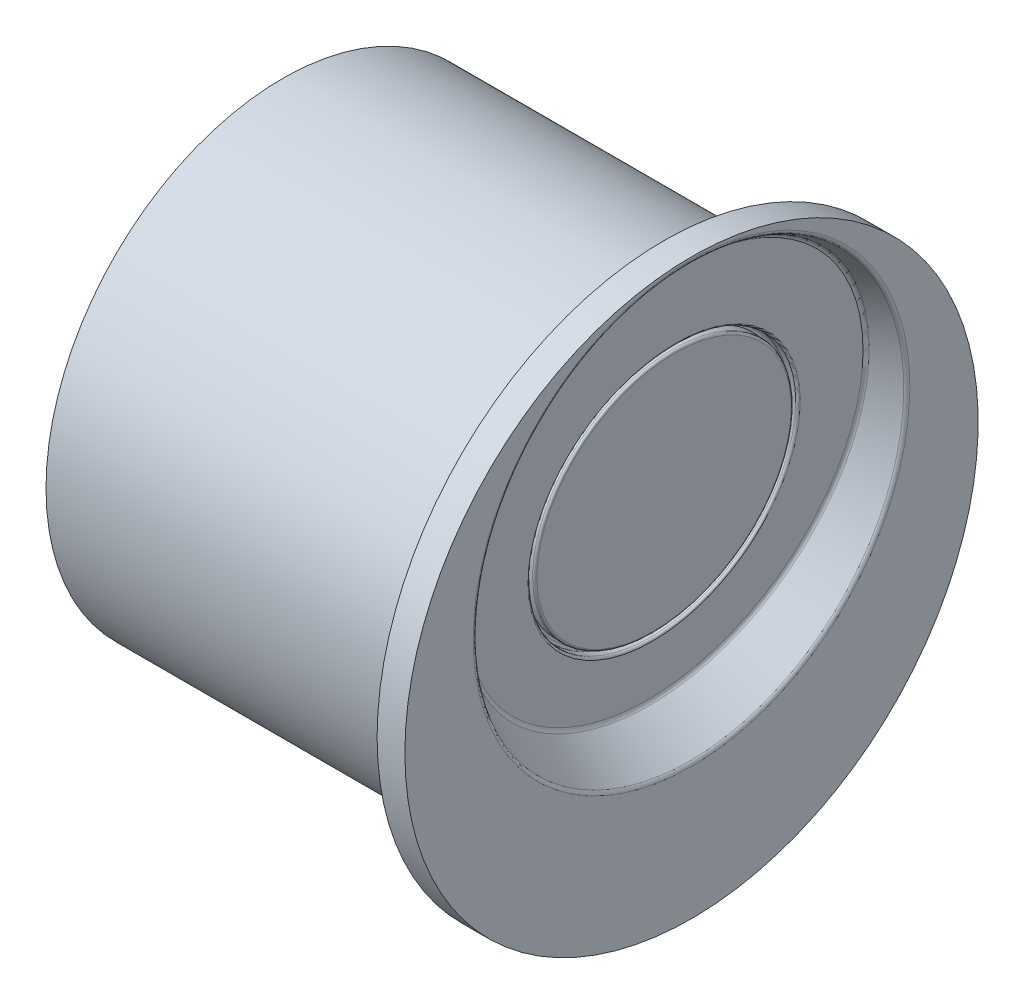
ISO-10303-21;
HEADER;
FILE_DESCRIPTION(('STEP AP214'),'2;1');
FILE_NAME('part.step','',(''),(''),'','','');
FILE_SCHEMA(('AUTOMOTIVE_DESIGN { 1 0 10303 214 1 1 1 1 }'));
ENDSEC;
DATA;
#1=APPLICATION_CONTEXT('core data for automotive mechanical design processes');
#2=APPLICATION_PROTOCOL_DEFINITION('international standard','automotive_design',2000,#1);
#3=PRODUCT_CONTEXT('',#1,'mechanical');
#4=PRODUCT('Part','Part','',(#3));
#5=PRODUCT_RELATED_PRODUCT_CATEGORY('part','',(#4));
#6=PRODUCT_DEFINITION_FORMATION('','',#4);
#7=PRODUCT_DEFINITION_CONTEXT('part definition',#1,'design');
#8=PRODUCT_DEFINITION('design','',#6,#7);
#9=PRODUCT_DEFINITION_SHAPE('','',#8);
#10=(LENGTH_UNIT() NAMED_UNIT(*) SI_UNIT(.MILLI.,.METRE.));
#11=(NAMED_UNIT(*) PLANE_ANGLE_UNIT() SI_UNIT($,.RADIAN.));
#12=(NAMED_UNIT(*) SI_UNIT($,.STERADIAN.) SOLID_ANGLE_UNIT());
#13=UNCERTAINTY_MEASURE_WITH_UNIT(LENGTH_MEASURE(1.E-05),#10,'distance_accuracy_value','');
#14=(GEOMETRIC_REPRESENTATION_CONTEXT(3) GLOBAL_UNCERTAINTY_ASSIGNED_CONTEXT((#13)) GLOBAL_UNIT_ASSIGNED_CONTEXT((#10,
#11,#12)) REPRESENTATION_CONTEXT('',''));
#15=CARTESIAN_POINT('',(0.,0.,0.));
#16=DIRECTION('',(0.,0.,1.));
#17=DIRECTION('',(1.,0.,0.));
#18=AXIS2_PLACEMENT_3D('',#15,#16,#17);
#19=CARTESIAN_POINT('',(0.,0.,0.));
#20=DIRECTION('',(1.,0.,0.));
#21=DIRECTION('',(0.,0.,-1.));
#22=AXIS2_PLACEMENT_3D('',#19,#20,#21);
#23=PLANE('',#22);
#24=CARTESIAN_POINT('',(0.,-8.52044164244044,0.));
#25=DIRECTION('',(1.,0.,0.));
#26=DIRECTION('',(0.,0.,-1.));
#27=AXIS2_PLACEMENT_3D('',#24,#25,#26);
#28=CIRCLE('',#27,1.5);
#29=CARTESIAN_POINT('',(0.,-8.52044164244044,-1.5));
#30=VERTEX_POINT('',#29);
#31=EDGE_CURVE('E12',#30,#30,#28,.F.);
#32=ORIENTED_EDGE('',*,*,#31,.F.);
#33=EDGE_LOOP('',(#32));
#34=FACE_BOUND('',#33,.T.);
#35=CARTESIAN_POINT('',(0.,0.,0.));
#36=DIRECTION('',(-1.,0.,0.));
#37=DIRECTION('',(0.,0.,1.));
#38=AXIS2_PLACEMENT_3D('',#35,#36,#37);
#39=CIRCLE('',#38,10.65);
#40=CARTESIAN_POINT('',(0.,0.,10.65));
#41=VERTEX_POINT('',#40);
#42=EDGE_CURVE('E118',#41,#41,#39,.T.);
#43=ORIENTED_EDGE('',*,*,#42,.T.);
#44=EDGE_LOOP('',(#43));
#45=FACE_BOUND('',#44,.T.);
#46=ADVANCED_FACE('F44',(#34,#45),#23,.F.);
#47=CARTESIAN_POINT('',(0.,0.,0.));
#48=DIRECTION('',(-1.,0.,0.));
#49=DIRECTION('',(0.,0.,1.));
#50=AXIS2_PLACEMENT_3D('',#47,#48,#49);
#51=CYLINDRICAL_SURFACE('',#50,10.65);
#52=ORIENTED_EDGE('',*,*,#42,.F.);
#53=EDGE_LOOP('',(#52));
#54=FACE_BOUND('',#53,.T.);
#55=CARTESIAN_POINT('',(17.15,0.,0.));
#56=DIRECTION('',(-1.,0.,0.));
#57=DIRECTION('',(0.,0.,1.));
#58=AXIS2_PLACEMENT_3D('',#55,#56,#57);
#59=CIRCLE('',#58,10.65);
#60=CARTESIAN_POINT('',(17.15,0.,10.65));
#61=VERTEX_POINT('',#60);
#62=EDGE_CURVE('E120',#61,#61,#59,.T.);
#63=ORIENTED_EDGE('',*,*,#62,.T.);
#64=EDGE_LOOP('',(#63));
#65=FACE_BOUND('',#64,.T.);
#66=ADVANCED_FACE('F107',(#54,#65),#51,.T.);
#67=CARTESIAN_POINT('',(17.15,10.65,1.11022302462516E-13));
#68=DIRECTION('',(1.,0.,0.));
#69=DIRECTION('',(0.,0.,-1.));
#70=AXIS2_PLACEMENT_3D('',#67,#68,#69);
#71=PLANE('',#70);
#72=ORIENTED_EDGE('',*,*,#62,.F.);
#73=EDGE_LOOP('',(#72));
#74=FACE_BOUND('',#73,.T.);
#75=CARTESIAN_POINT('',(17.15,0.,0.));
#76=DIRECTION('',(-1.,0.,0.));
#77=DIRECTION('',(0.,0.,1.));
#78=AXIS2_PLACEMENT_3D('',#75,#76,#77);
#79=CIRCLE('',#78,12.9);
#80=CARTESIAN_POINT('',(17.15,0.,12.9));
#81=VERTEX_POINT('',#80);
#82=EDGE_CURVE('E126',#81,#81,#79,.T.);
#83=ORIENTED_EDGE('',*,*,#82,.T.);
#84=EDGE_LOOP('',(#83));
#85=FACE_BOUND('',#84,.T.);
#86=ADVANCED_FACE('F103',(#74,#85),#71,.F.);
#87=CARTESIAN_POINT('',(0.,0.,0.));
#88=DIRECTION('',(-1.,0.,0.));
#89=DIRECTION('',(0.,0.,1.));
#90=AXIS2_PLACEMENT_3D('',#87,#88,#89);
#91=CYLINDRICAL_SURFACE('',#90,12.9);
#92=ORIENTED_EDGE('',*,*,#82,.F.);
#93=EDGE_LOOP('',(#92));
#94=FACE_BOUND('',#93,.T.);
#95=CARTESIAN_POINT('',(18.4,0.,0.));
#96=DIRECTION('',(-1.,0.,0.));
#97=DIRECTION('',(0.,0.,1.));
#98=AXIS2_PLACEMENT_3D('',#95,#96,#97);
#99=CIRCLE('',#98,12.9);
#100=CARTESIAN_POINT('',(18.4,0.,12.9));
#101=VERTEX_POINT('',#100);
#102=EDGE_CURVE('E197',#101,#101,#99,.T.);
#103=ORIENTED_EDGE('',*,*,#102,.T.);
#104=EDGE_LOOP('',(#103));
#105=FACE_BOUND('',#104,.T.);
#106=ADVANCED_FACE('F98',(#94,#105),#91,.T.);
#107=CARTESIAN_POINT('',(18.4,12.9,1.11022302462516E-13));
#108=DIRECTION('',(-1.,0.,0.));
#109=DIRECTION('',(0.,0.,1.));
#110=AXIS2_PLACEMENT_3D('',#107,#108,#109);
#111=PLANE('',#110);
#112=CARTESIAN_POINT('',(18.4,2.91045065210331,0.));
#113=DIRECTION('',(-1.,0.,0.));
#114=DIRECTION('',(0.,-1.,0.));
#115=AXIS2_PLACEMENT_3D('',#112,#113,#114);
#116=ELLIPSE('',#115,9.87305269639279,9.82292750264107);
#117=CARTESIAN_POINT('',(18.4,-6.96260204428948,0.));
#118=VERTEX_POINT('',#117);
#119=EDGE_CURVE('E134',#118,#118,#116,.T.);
#120=ORIENTED_EDGE('',*,*,#119,.T.);
#121=EDGE_LOOP('',(#120));
#122=FACE_BOUND('',#121,.T.);
#123=ORIENTED_EDGE('',*,*,#102,.F.);
#124=EDGE_LOOP('',(#123));
#125=FACE_BOUND('',#124,.T.);
#126=ADVANCED_FACE('F93',(#122,#125),#111,.F.);
#127=CARTESIAN_POINT('',(17.2001854504329,3.49662681333875,1.11022302462516E-13));
#128=DIRECTION('',(0.996194698091746,-0.0871557427476584,0.));
#129=DIRECTION('',(0.0871557427476584,0.996194698091746,0.));
#130=AXIS2_PLACEMENT_3D('',#127,#128,#129);
#131=CONICAL_SURFACE('',#130,9.,0.5235987755983);
#132=CARTESIAN_POINT('',(18.3147152872702,-6.79877163543167,0.));
#133=CARTESIAN_POINT('',(18.4,-6.85848863417913,0.));
#134=CARTESIAN_POINT('',(18.4,-6.96260204428948,0.));
#135=CARTESIAN_POINT('',(18.3147152872702,-6.79877163543167,0.421432648544949));
#136=CARTESIAN_POINT('',(18.4,-6.85848863417913,0.424051456379861));
#137=CARTESIAN_POINT('',(18.4,-6.96260204428948,0.428617780551499));
#138=CARTESIAN_POINT('',(18.3146762784061,-6.7709785651938,0.842865297089897));
#139=CARTESIAN_POINT('',(18.4,-6.83051310274359,0.848155472180747));
#140=CARTESIAN_POINT('',(18.4,-6.93436310069507,0.857235561102998));
#141=CARTESIAN_POINT('',(18.3145207319939,-6.66029397078169,1.67850129453651));
#142=CARTESIAN_POINT('',(18.4,-6.7191298960778,1.68898061866346));
#143=CARTESIAN_POINT('',(18.4,-6.82190060265591,1.70713651334909));
#144=CARTESIAN_POINT('',(18.3144041810495,-6.5773929260865,2.09270338158604));
#145=CARTESIAN_POINT('',(18.4,-6.63568519932079,2.10580228266912));
#146=CARTESIAN_POINT('',(18.4,-6.73766737457014,2.12841840477889));
#147=CARTESIAN_POINT('',(18.3140949919593,-6.3579268870819,2.90677636408372));
#148=CARTESIAN_POINT('',(18.4,-6.41483522485625,2.9249199045589));
#149=CARTESIAN_POINT('',(18.4,-6.51466728809329,2.95644115782344));
#150=CARTESIAN_POINT('',(18.3139023284367,-6.2213439946855,3.30664243118251));
#151=CARTESIAN_POINT('',(18.4,-6.27735861828374,3.32730303730977));
#152=CARTESIAN_POINT('',(18.4,-6.37588224155664,3.36317712027882));
#153=CARTESIAN_POINT('',(18.3134433140879,-5.89686966020514,4.08519112506975));
#154=CARTESIAN_POINT('',(18.4,-5.9508414129455,4.1106584903477));
#155=CARTESIAN_POINT('',(18.4,-6.04616134906124,4.15515279557359));
#156=CARTESIAN_POINT('',(18.313176928556,-5.70895405308715,4.46386367353152));
#157=CARTESIAN_POINT('',(18.4,-5.76170035571671,4.49169700470973));
#158=CARTESIAN_POINT('',(18.4,-5.85520094138118,4.54038228104815));
#159=CARTESIAN_POINT('',(18.312573838078,-5.28504887379303,5.19354021615205));
#160=CARTESIAN_POINT('',(18.4,-5.33513246431951,5.22585351234596));
#161=CARTESIAN_POINT('',(18.4,-5.42440240638094,5.28275932604668));
#162=CARTESIAN_POINT('',(18.3122370926482,-5.04903162673383,5.54452812020758));
#163=CARTESIAN_POINT('',(18.4,-5.09758321463093,5.57901087555755));
#164=CARTESIAN_POINT('',(18.4,-5.18453614144561,5.63989055477982));
#165=CARTESIAN_POINT('',(18.3114976292401,-4.5329803033066,6.21282818945057));
#166=CARTESIAN_POINT('',(18.4,-4.57830052192187,6.25138143725743));
#167=CARTESIAN_POINT('',(18.4,-4.6600327125887,6.31996670772754));
#168=CARTESIAN_POINT('',(18.3110948689961,-4.2529180318373,6.53011856393778));
#169=CARTESIAN_POINT('',(18.4,-4.29643124569167,6.57060356028817));
#170=CARTESIAN_POINT('',(18.4,-4.3753668704642,6.64288951052846));
#171=CARTESIAN_POINT('',(18.3102287110527,-3.65358586779546,7.12559662312212));
#172=CARTESIAN_POINT('',(18.4,-3.69336146037285,7.16966794911444));
#173=CARTESIAN_POINT('',(18.4,-3.76613447582725,7.24902913332239));
#174=CARTESIAN_POINT('',(18.3097652732328,-3.33429004229333,7.4037581807938));
#175=CARTESIAN_POINT('',(18.4,-3.37202089389836,7.44948751891646));
#176=CARTESIAN_POINT('',(18.4,-3.44154153180479,7.53221942286548));
#177=CARTESIAN_POINT('',(18.3087840869297,-2.66196898741409,7.91622407534939));
#178=CARTESIAN_POINT('',(18.4,-2.69552844132112,7.96499056781019));
#179=CARTESIAN_POINT('',(18.4,-2.75800546616178,8.05405248601247));
#180=CARTESIAN_POINT('',(18.3082663038188,-2.30892226565968,8.15050018145343));
#181=CARTESIAN_POINT('',(18.4,-2.3402414013832,8.2006210023143));
#182=CARTESIAN_POINT('',(18.4,-2.39904045636878,8.29266658422792));
#183=CARTESIAN_POINT('',(18.307183738271,-1.57515241837699,8.57119367287808));
#184=CARTESIAN_POINT('',(18.4,-1.6019474692659,8.62374870909831));
#185=CARTESIAN_POINT('',(18.4,-1.65289682825337,8.72126591693836));
#186=CARTESIAN_POINT('',(18.3066189290238,-1.19441352102749,8.75758350677644));
#187=CARTESIAN_POINT('',(18.4,-1.21881873019346,8.81116610772453));
#188=CARTESIAN_POINT('',(18.4,-1.26570213166746,8.91122315646618));
#189=CARTESIAN_POINT('',(18.3054505838389,-0.411783286252475,9.07932373851851));
#190=CARTESIAN_POINT('',(18.4,-0.431399653217262,9.13469647995205));
#191=CARTESIAN_POINT('',(18.4,-0.469717650321774,9.23925695840027));
#192=CARTESIAN_POINT('',(18.3048470298928,-0.00988212845522013,9.21465019819542));
#193=CARTESIAN_POINT('',(18.4,-0.0270079085690723,9.27070815971439));
#194=CARTESIAN_POINT('',(18.4,-0.0609178393521075,9.37730918797804));
#195=CARTESIAN_POINT('',(18.3036103840825,0.808189405603323,9.43195754941596));
#196=CARTESIAN_POINT('',(18.4,0.796024533317315,9.4891341670031));
#197=CARTESIAN_POINT('',(18.4,0.771288620997772,9.59916622904305));
#198=CARTESIAN_POINT('',(18.3029772825136,1.22436445799136,9.51392078001409));
#199=CARTESIAN_POINT('',(18.4,1.21474073727516,9.57143261308743));
#200=CARTESIAN_POINT('',(18.4,1.19470005743091,9.68295308096432));
#201=CARTESIAN_POINT('',(18.3016915734984,2.06385906028851,9.62310906820288));
#202=CARTESIAN_POINT('',(18.4,2.05927320208149,9.68105511159203));
#203=CARTESIAN_POINT('',(18.4,2.04889038101807,9.79483848394641));
#204=CARTESIAN_POINT('',(18.3010389627326,2.48717982064426,9.65032475607572));
#205=CARTESIAN_POINT('',(18.4,2.48513553427024,9.70825642976725));
#206=CARTESIAN_POINT('',(18.4,2.47967051656069,9.82292750264107));
#207=CARTESIAN_POINT('',(18.299725004776,3.33372148356236,9.64956228920134));
#208=CARTESIAN_POINT('',(18.4,3.33669701433013,9.70724546569338));
#209=CARTESIAN_POINT('',(18.4,3.34123078764593,9.82292750264107));
#210=CARTESIAN_POINT('',(18.2990636575853,3.75694238612472,9.62158413445413));
#211=CARTESIAN_POINT('',(18.4,3.76241129391488,9.6789117006908));
#212=CARTESIAN_POINT('',(18.4,3.77201092318855,9.79483848394641));
#213=CARTESIAN_POINT('',(18.2977435906233,4.59604427529311,9.51092267777844));
#214=CARTESIAN_POINT('',(18.4,4.60642266791989,9.56733518079615));
#215=CARTESIAN_POINT('',(18.4,4.62620124677571,9.68295308096432));
#216=CARTESIAN_POINT('',(18.2970848704218,5.01192650537063,9.42824873673305));
#217=CARTESIAN_POINT('',(18.4,5.02470446101145,9.48398015795921));
#218=CARTESIAN_POINT('',(18.4,5.04961268320885,9.59916622904305));
#219=CARTESIAN_POINT('',(18.2957818330601,5.8292391805239,9.20962003754667));
#220=CARTESIAN_POINT('',(18.4,5.84672923877985,9.26379948612822));
#221=CARTESIAN_POINT('',(18.4,5.88181914355873,9.37730918797804));
#222=CARTESIAN_POINT('',(18.2951375112091,6.23067435903689,9.0736829073368));
#223=CARTESIAN_POINT('',(18.4,6.25042888095605,9.12687813980086));
#224=CARTESIAN_POINT('',(18.4,6.29061895452839,9.23925695840028));
#225=CARTESIAN_POINT('',(18.2938752357133,7.01223096544466,8.75086300048835));
#226=CARTESIAN_POINT('',(18.4,7.03642066521761,8.80191104799252));
#227=CARTESIAN_POINT('',(18.4,7.08660343587408,8.91122315646618));
#228=CARTESIAN_POINT('',(18.2932572698694,7.39236228011377,8.56400409585158));
#229=CARTESIAN_POINT('',(18.4,7.41864549004198,8.61379251355688));
#230=CARTESIAN_POINT('',(18.4,7.47379813245998,8.72126591693836));
#231=CARTESIAN_POINT('',(18.2920596021941,8.12481650405874,8.14254618105672));
#232=CARTESIAN_POINT('',(18.4,8.15518776701017,8.18964394657092));
#233=CARTESIAN_POINT('',(18.4,8.2199417605754,8.29266658422792));
#234=CARTESIAN_POINT('',(18.2914798786125,8.47715524299255,7.90797462280631));
#235=CARTESIAN_POINT('',(18.4,8.50941938757331,7.9535690052061));
#236=CARTESIAN_POINT('',(18.4,8.5789067703684,8.05405248601247));
#237=CARTESIAN_POINT('',(18.2903702326676,9.14800799744811,7.3951118481707));
#238=CARTESIAN_POINT('',(18.4,9.18395344988355,7.43753153140861));
#239=CARTESIAN_POINT('',(18.4,9.26244283601141,7.53221942286548));
#240=CARTESIAN_POINT('',(18.2898402786357,9.46654353916761,7.11684873837921));
#241=CARTESIAN_POINT('',(18.4,9.50415806033944,7.15755529619753));
#242=CARTESIAN_POINT('',(18.4,9.58703578003388,7.24902913332239));
#243=CARTESIAN_POINT('',(18.2888410406289,10.0643545911248,6.52136873089735));
#244=CARTESIAN_POINT('',(18.4,10.1051951601599,6.55848108691516));
#245=CARTESIAN_POINT('',(18.4,10.1962681746708,6.64288951052846));
#246=CARTESIAN_POINT('',(18.2883717165945,10.343656034989,6.20417782668168));
#247=CARTESIAN_POINT('',(18.4,10.3859249956847,6.2394020926042));
#248=CARTESIAN_POINT('',(18.4,10.4809340167953,6.31996670772755));
#249=CARTESIAN_POINT('',(18.2875036217996,10.8582370949365,5.53627126893138));
#250=CARTESIAN_POINT('',(18.4,10.9032392124622,5.56754901666891));
#251=CARTESIAN_POINT('',(18.4,11.0054374456522,5.63989055477982));
#252=CARTESIAN_POINT('',(18.2871048059125,11.0935448734232,5.18557728107231));
#253=CARTESIAN_POINT('',(18.4,11.1397235223584,5.21482610968249));
#254=CARTESIAN_POINT('',(18.4,11.2453037105876,5.28275932604668));
#255=CARTESIAN_POINT('',(18.2863863158356,11.5161310292644,4.45666323577983));
#256=CARTESIAN_POINT('',(18.4,11.5645222895675,4.48168090458));
#257=CARTESIAN_POINT('',(18.4,11.6761022455878,4.54038228104815));
#258=CARTESIAN_POINT('',(18.2860665961419,11.7034370241235,4.07845916763287));
#259=CARTESIAN_POINT('',(18.4,11.7527464272354,4.10133951354625));
#260=CARTESIAN_POINT('',(18.4,11.8670626532679,4.1551527955736));
#261=CARTESIAN_POINT('',(18.2855133079912,12.0268338041181,3.30099019336642));
#262=CARTESIAN_POINT('',(18.4,12.0778161681051,3.31942130591012));
#263=CARTESIAN_POINT('',(18.4,12.1967835457633,3.36317712027882));
#264=CARTESIAN_POINT('',(18.2852796989983,12.1629486876476,2.90173529818086));
#265=CARTESIAN_POINT('',(18.4,12.2145876666843,2.91795079971185));
#266=CARTESIAN_POINT('',(18.4,12.3355685922999,2.95644115782345));
#267=CARTESIAN_POINT('',(18.2849038208846,12.3816524676254,2.08898567872367));
#268=CARTESIAN_POINT('',(18.4,12.4344125075671,2.10059845191965));
#269=CARTESIAN_POINT('',(18.4,12.5585686787768,2.12841840477889));
#270=CARTESIAN_POINT('',(18.2847615213204,12.4642592042499,1.67549574903515));
#271=CARTESIAN_POINT('',(18.4,12.5174132726232,1.68484236316989));
#272=CARTESIAN_POINT('',(18.4,12.6428019068625,1.70713651334909));
#273=CARTESIAN_POINT('',(18.2845714452157,12.5745491224708,0.841336377702611));
#274=CARTESIAN_POINT('',(18.4,12.6282653023983,0.845989229593816));
#275=CARTESIAN_POINT('',(18.4,12.7552644049017,0.857235561103001));
#276=CARTESIAN_POINT('',(18.2845236523481,12.6022417910888,0.420668188851307));
#277=CARTESIAN_POINT('',(18.4,12.6560892963346,0.423030145538588));
#278=CARTESIAN_POINT('',(18.4,12.7835033484961,0.428617780551501));
#279=CARTESIAN_POINT('',(18.2845236523481,12.6022417910888,-0.4206681888513));
#280=CARTESIAN_POINT('',(18.4,12.6560892963346,-0.423030145538583));
#281=CARTESIAN_POINT('',(18.4,12.7835033484961,-0.428617780551499));
#282=CARTESIAN_POINT('',(18.2845714452158,12.5745491224708,-0.841336377702603));
#283=CARTESIAN_POINT('',(18.4,12.6282653023983,-0.845989229593811));
#284=CARTESIAN_POINT('',(18.4,12.7552644049017,-0.857235561102998));
#285=CARTESIAN_POINT('',(18.2847615213205,12.4642592042499,-1.67549574903514));
#286=CARTESIAN_POINT('',(18.4,12.5174132726232,-1.68484236316988));
#287=CARTESIAN_POINT('',(18.4,12.6428019068625,-1.70713651334909));
#288=CARTESIAN_POINT('',(18.2849038208846,12.3816524676254,-2.08898567872366));
#289=CARTESIAN_POINT('',(18.4,12.4344125075671,-2.10059845191964));
#290=CARTESIAN_POINT('',(18.4,12.5585686787768,-2.12841840477889));
#291=CARTESIAN_POINT('',(18.2852796989983,12.1629486876476,-2.90173529818084));
#292=CARTESIAN_POINT('',(18.4,12.2145876666843,-2.91795079971185));
#293=CARTESIAN_POINT('',(18.4,12.3355685922999,-2.95644115782344));
#294=CARTESIAN_POINT('',(18.2855133079912,12.026833804118,-3.30099019336639));
#295=CARTESIAN_POINT('',(18.4,12.0778161681051,-3.31942130591012));
#296=CARTESIAN_POINT('',(18.4,12.1967835457633,-3.36317712027882));
#297=CARTESIAN_POINT('',(18.2860665961419,11.7034370241234,-4.07845916763283));
#298=CARTESIAN_POINT('',(18.4,11.7527464272354,-4.10133951354624));
#299=CARTESIAN_POINT('',(18.4,11.8670626532679,-4.15515279557359));
#300=CARTESIAN_POINT('',(18.2863863158356,11.5161310292643,-4.45666323577978));
#301=CARTESIAN_POINT('',(18.4,11.5645222895675,-4.48168090458));
#302=CARTESIAN_POINT('',(18.4,11.6761022455878,-4.54038228104814));
#303=CARTESIAN_POINT('',(18.2871048059126,11.0935448734231,-5.18557728107225));
#304=CARTESIAN_POINT('',(18.4,11.1397235223584,-5.21482610968249));
#305=CARTESIAN_POINT('',(18.4,11.2453037105876,-5.28275932604668));
#306=CARTESIAN_POINT('',(18.2875036217997,10.8582370949364,-5.53627126893131));
#307=CARTESIAN_POINT('',(18.4,10.9032392124622,-5.56754901666891));
#308=CARTESIAN_POINT('',(18.4,11.0054374456522,-5.63989055477982));
#309=CARTESIAN_POINT('',(18.2883717165946,10.343656034989,-6.2041778266816));
#310=CARTESIAN_POINT('',(18.4,10.3859249956847,-6.23940209260419));
#311=CARTESIAN_POINT('',(18.4,10.4809340167953,-6.31996670772754));
#312=CARTESIAN_POINT('',(18.288841040629,10.0643545911247,-6.52136873089727));
#313=CARTESIAN_POINT('',(18.4,10.1051951601599,-6.55848108691516));
#314=CARTESIAN_POINT('',(18.4,10.1962681746708,-6.64288951052846));
#315=CARTESIAN_POINT('',(18.2898402786357,9.46654353916752,-7.11684873837911));
#316=CARTESIAN_POINT('',(18.4,9.50415806033944,-7.15755529619753));
#317=CARTESIAN_POINT('',(18.4,9.58703578003388,-7.24902913332239));
#318=CARTESIAN_POINT('',(18.2903702326677,9.14800799744803,-7.39511184817059));
#319=CARTESIAN_POINT('',(18.4,9.18395344988355,-7.43753153140861));
#320=CARTESIAN_POINT('',(18.4,9.26244283601141,-7.53221942286548));
#321=CARTESIAN_POINT('',(18.2914798786125,8.47715524299248,-7.90797462280619));
#322=CARTESIAN_POINT('',(18.4,8.50941938757332,-7.95356900520609));
#323=CARTESIAN_POINT('',(18.4,8.5789067703684,-8.05405248601246));
#324=CARTESIAN_POINT('',(18.2920596021942,8.12481650405867,-8.14254618105659));
#325=CARTESIAN_POINT('',(18.4,8.15518776701017,-8.18964394657091));
#326=CARTESIAN_POINT('',(18.4,8.2199417605754,-8.29266658422791));
#327=CARTESIAN_POINT('',(18.2932572698695,7.39236228011371,-8.56400409585144));
#328=CARTESIAN_POINT('',(18.4,7.41864549004198,-8.61379251355688));
#329=CARTESIAN_POINT('',(18.4,7.47379813245999,-8.72126591693836));
#330=CARTESIAN_POINT('',(18.2938752357134,7.01223096544459,-8.7508630004882));
#331=CARTESIAN_POINT('',(18.4,7.03642066521761,-8.80191104799252));
#332=CARTESIAN_POINT('',(18.4,7.08660343587408,-8.91122315646618));
#333=CARTESIAN_POINT('',(18.2951375112092,6.23067435903683,-9.07368290733664));
#334=CARTESIAN_POINT('',(18.4,6.25042888095605,-9.12687813980086));
#335=CARTESIAN_POINT('',(18.4,6.29061895452839,-9.23925695840028));
#336=CARTESIAN_POINT('',(18.2957818330602,5.82923918052385,-9.20962003754652));
#337=CARTESIAN_POINT('',(18.4,5.84672923877985,-9.26379948612822));
#338=CARTESIAN_POINT('',(18.4,5.88181914355873,-9.37730918797804));
#339=CARTESIAN_POINT('',(18.2970848704219,5.0119265053706,-9.42824873673289));
#340=CARTESIAN_POINT('',(18.4,5.02470446101145,-9.48398015795921));
#341=CARTESIAN_POINT('',(18.4,5.04961268320885,-9.59916622904305));
#342=CARTESIAN_POINT('',(18.2977435906234,4.59604427529308,-9.51092267777828));
#343=CARTESIAN_POINT('',(18.4,4.6064226679199,-9.56733518079615));
#344=CARTESIAN_POINT('',(18.4,4.62620124677571,-9.68295308096432));
#345=CARTESIAN_POINT('',(18.2990636575854,3.75694238612471,-9.62158413445396));
#346=CARTESIAN_POINT('',(18.4,3.76241129391488,-9.67891170069081));
#347=CARTESIAN_POINT('',(18.4,3.77201092318856,-9.79483848394641));
#348=CARTESIAN_POINT('',(18.2997250047761,3.33372148356236,-9.64956228920117));
#349=CARTESIAN_POINT('',(18.4,3.33669701433012,-9.70724546569338));
#350=CARTESIAN_POINT('',(18.4,3.34123078764593,-9.82292750264107));
#351=CARTESIAN_POINT('',(18.3010389627327,2.48717982064427,-9.65032475607555));
#352=CARTESIAN_POINT('',(18.4,2.48513553427024,-9.70825642976725));
#353=CARTESIAN_POINT('',(18.4,2.47967051656069,-9.82292750264107));
#354=CARTESIAN_POINT('',(18.3016915734985,2.06385906028853,-9.62310906820271));
#355=CARTESIAN_POINT('',(18.4,2.0592732020815,-9.68105511159203));
#356=CARTESIAN_POINT('',(18.4,2.04889038101807,-9.79483848394641));
#357=CARTESIAN_POINT('',(18.3029772825137,1.22436445799139,-9.51392078001393));
#358=CARTESIAN_POINT('',(18.4,1.21474073727516,-9.57143261308743));
#359=CARTESIAN_POINT('',(18.4,1.19470005743091,-9.68295308096433));
#360=CARTESIAN_POINT('',(18.3036103840826,0.808189405603361,-9.4319575494158));
#361=CARTESIAN_POINT('',(18.4,0.796024533317316,-9.4891341670031));
#362=CARTESIAN_POINT('',(18.4,0.771288620997776,-9.59916622904305));
#363=CARTESIAN_POINT('',(18.3048470298929,-0.00988212845517011,-9.21465019819527));
#364=CARTESIAN_POINT('',(18.4,-0.0270079085690656,-9.27070815971439));
#365=CARTESIAN_POINT('',(18.4,-0.0609178393521022,-9.37730918797804));
#366=CARTESIAN_POINT('',(18.305450583839,-0.411783286252418,-9.07932373851837));
#367=CARTESIAN_POINT('',(18.4,-0.431399653217255,-9.13469647995204));
#368=CARTESIAN_POINT('',(18.4,-0.469717650321767,-9.23925695840028));
#369=CARTESIAN_POINT('',(18.3066189290239,-1.19441352102743,-8.7575835067763));
#370=CARTESIAN_POINT('',(18.4,-1.21881873019346,-8.81116610772453));
#371=CARTESIAN_POINT('',(18.4,-1.26570213166746,-8.91122315646618));
#372=CARTESIAN_POINT('',(18.3071837382711,-1.57515241837693,-8.57119367287795));
#373=CARTESIAN_POINT('',(18.4,-1.6019474692659,-8.62374870909831));
#374=CARTESIAN_POINT('',(18.4,-1.65289682825336,-8.72126591693836));
#375=CARTESIAN_POINT('',(18.3082663038189,-2.30892226565961,-8.15050018145331));
#376=CARTESIAN_POINT('',(18.4,-2.3402414013832,-8.2006210023143));
#377=CARTESIAN_POINT('',(18.4,-2.39904045636877,-8.29266658422792));
#378=CARTESIAN_POINT('',(18.3087840869298,-2.66196898741401,-7.91622407534928));
#379=CARTESIAN_POINT('',(18.4,-2.69552844132112,-7.96499056781019));
#380=CARTESIAN_POINT('',(18.4,-2.75800546616177,-8.05405248601247));
#381=CARTESIAN_POINT('',(18.3097652732329,-3.33429004229325,-7.40375818079371));
#382=CARTESIAN_POINT('',(18.4,-3.37202089389836,-7.44948751891646));
#383=CARTESIAN_POINT('',(18.4,-3.44154153180478,-7.53221942286549));
#384=CARTESIAN_POINT('',(18.3102287110528,-3.65358586779538,-7.12559662312203));
#385=CARTESIAN_POINT('',(18.4,-3.69336146037285,-7.16966794911444));
#386=CARTESIAN_POINT('',(18.4,-3.76613447582725,-7.2490291333224));
#387=CARTESIAN_POINT('',(18.3110948689961,-4.25291803183722,-6.53011856393771));
#388=CARTESIAN_POINT('',(18.4,-4.29643124569167,-6.57060356028817));
#389=CARTESIAN_POINT('',(18.4,-4.3753668704642,-6.64288951052846));
#390=CARTESIAN_POINT('',(18.3114976292402,-4.53298030330652,-6.2128281894505));
#391=CARTESIAN_POINT('',(18.4,-4.57830052192187,-6.25138143725742));
#392=CARTESIAN_POINT('',(18.4,-4.6600327125887,-6.31996670772755));
#393=CARTESIAN_POINT('',(18.3122370926482,-5.04903162673376,-5.54452812020753));
#394=CARTESIAN_POINT('',(18.4,-5.09758321463093,-5.57901087555755));
#395=CARTESIAN_POINT('',(18.4,-5.18453614144561,-5.63989055477983));
#396=CARTESIAN_POINT('',(18.3125738380781,-5.28504887379296,-5.19354021615201));
#397=CARTESIAN_POINT('',(18.4,-5.3351324643195,-5.22585351234596));
#398=CARTESIAN_POINT('',(18.4,-5.42440240638094,-5.28275932604669));
#399=CARTESIAN_POINT('',(18.313176928556,-5.70895405308709,-4.46386367353149));
#400=CARTESIAN_POINT('',(18.4,-5.76170035571671,-4.49169700470973));
#401=CARTESIAN_POINT('',(18.4,-5.85520094138118,-4.54038228104815));
#402=CARTESIAN_POINT('',(18.3134433140879,-5.89686966020508,-4.08519112506972));
#403=CARTESIAN_POINT('',(18.4,-5.95084141294551,-4.11065849034769));
#404=CARTESIAN_POINT('',(18.4,-6.04616134906124,-4.1551527955736));
#405=CARTESIAN_POINT('',(18.3139023284368,-6.22134399468545,-3.30664243118249));
#406=CARTESIAN_POINT('',(18.4,-6.27735861828374,-3.32730303730978));
#407=CARTESIAN_POINT('',(18.4,-6.37588224155664,-3.36317712027882));
#408=CARTESIAN_POINT('',(18.3140949919594,-6.35792688708186,-2.9067763640837));
#409=CARTESIAN_POINT('',(18.4,-6.41483522485624,-2.9249199045589));
#410=CARTESIAN_POINT('',(18.4,-6.51466728809329,-2.95644115782345));
#411=CARTESIAN_POINT('',(18.3144041810495,-6.57739292608647,-2.09270338158604));
#412=CARTESIAN_POINT('',(18.4,-6.63568519932078,-2.10580228266912));
#413=CARTESIAN_POINT('',(18.4,-6.73766737457014,-2.12841840477889));
#414=CARTESIAN_POINT('',(18.3145207319939,-6.66029397078167,-1.67850129453651));
#415=CARTESIAN_POINT('',(18.4,-6.7191298960778,-1.68898061866346));
#416=CARTESIAN_POINT('',(18.4,-6.82190060265591,-1.70713651334909));
#417=CARTESIAN_POINT('',(18.3146762784062,-6.77097856519378,-0.842865297089894));
#418=CARTESIAN_POINT('',(18.4,-6.83051310274359,-0.848155472180747));
#419=CARTESIAN_POINT('',(18.4,-6.93436310069507,-0.857235561103));
#420=CARTESIAN_POINT('',(18.3147152872702,-6.79877163543166,-0.421432648544946));
#421=CARTESIAN_POINT('',(18.4,-6.85848863417913,-0.424051456379859));
#422=CARTESIAN_POINT('',(18.4,-6.96260204428948,-0.4286177805515));
#423=CARTESIAN_POINT('',(18.3147152872702,-6.79877163543167,0.));
#424=CARTESIAN_POINT('',(18.4,-6.85848863417913,0.));
#425=CARTESIAN_POINT('',(18.4,-6.96260204428948,0.));
#426=(BOUNDED_SURFACE() B_SPLINE_SURFACE(3,2,((#132,#133,#134),(#135,#136,#137),(#138,#139,
#140),(#141,#142,#143),(#144,#145,#146),(#147,#148,#149),(#150,#151,#152),(#153,#154,#155),
(#156,#157,#158),(#159,#160,#161),(#162,#163,#164),(#165,#166,#167),(#168,#169,#170),(#171,#172,
#173),(#174,#175,#176),(#177,#178,#179),(#180,#181,#182),(#183,#184,#185),(#186,#187,#188),
(#189,#190,#191),(#192,#193,#194),(#195,#196,#197),(#198,#199,#200),(#201,#202,#203),(#204,#205,
#206),(#207,#208,#209),(#210,#211,#212),(#213,#214,#215),(#216,#217,#218),(#219,#220,#221),
(#222,#223,#224),(#225,#226,#227),(#228,#229,#230),(#231,#232,#233),(#234,#235,#236),(#237,#238,
#239),(#240,#241,#242),(#243,#244,#245),(#246,#247,#248),(#249,#250,#251),(#252,#253,#254),
(#255,#256,#257),(#258,#259,#260),(#261,#262,#263),(#264,#265,#266),(#267,#268,#269),(#270,#271,
#272),(#273,#274,#275),(#276,#277,#278),(#279,#280,#281),(#282,#283,#284),(#285,#286,#287),
(#288,#289,#290),(#291,#292,#293),(#294,#295,#296),(#297,#298,#299),(#300,#301,#302),(#303,#304,
#305),(#306,#307,#308),(#309,#310,#311),(#312,#313,#314),(#315,#316,#317),(#318,#319,#320),
(#321,#322,#323),(#324,#325,#326),(#327,#328,#329),(#330,#331,#332),(#333,#334,#335),(#336,#337,
#338),(#339,#340,#341),(#342,#343,#344),(#345,#346,#347),(#348,#349,#350),(#351,#352,#353),
(#354,#355,#356),(#357,#358,#359),(#360,#361,#362),(#363,#364,#365),(#366,#367,#368),(#369,#370,
#371),(#372,#373,#374),(#375,#376,#377),(#378,#379,#380),(#381,#382,#383),(#384,#385,#386),
(#387,#388,#389),(#390,#391,#392),(#393,#394,#395),(#396,#397,#398),(#399,#400,#401),(#402,#403,
#404),(#405,#406,#407),(#408,#409,#410),(#411,#412,#413),(#414,#415,#416),(#417,#418,#419),
(#420,#421,#422),(#423,#424,#425)),.UNSPECIFIED.,.T.,.F.,.F.) B_SPLINE_SURFACE_WITH_KNOTS((4,2,
2,2,2,2,2,2,2,2,2,2,2,2,2,2,2,2,2,2,2,2,2,2,2,2,2,2,2,2,2,2,2,2,2,2,2,2,2,2,2,2,2,2,2,2,2,2,4),
(3,3),(0.,1.28492851169075,2.57007906691256,3.85565846868847,5.14184410698127,6.42877184127072,
7.71652677160282,9.00513751886586,10.2945743824901,11.5847514720424,12.8755326387341,
14.1667407818968,15.4581698888944,16.749598995892,18.0408071390546,19.3315883057463,
20.6217653952986,21.9112022589229,23.1998130061859,24.487567936518,25.7744956708075,
27.0606813091003,28.3462607108762,29.631411266098,30.9163397777887,32.2012682894795,
33.4864188447013,34.7719982464772,36.05818388477,37.3451116190594,38.6328665493915,
39.9214772966546,41.2109141602788,42.5010912498312,43.7918724165228,45.0830805596855,
46.3745096666831,47.6659387736807,48.9571469168433,50.247928083535,51.5381051730874,
52.8275420367116,54.1161527839746,55.4039077143067,56.6908354485962,57.977021086889,
59.2626004886649,60.5477510438867,61.8326795555774),(0.,1.),
.UNSPECIFIED.) GEOMETRIC_REPRESENTATION_ITEM() RATIONAL_B_SPLINE_SURFACE(((1.,0.887010833178222,
1.),(1.,0.887010833178222,1.),(1.,0.886955865925912,1.),(1.,0.88673662489666,1.),(1.,
0.886572332232519,1.),(1.,0.886136291609602,1.),(1.,0.885864507811972,1.),(1.,0.885216578028791,
1.),(1.,0.88484038288994,1.),(1.,0.883987995774913,1.),(1.,0.883511746228371,1.),(1.,
0.882464926732396,1.),(1.,0.881894296353584,1.),(1.,0.880665745246115,1.),(1.,0.880007766758015,
1.),(1.,0.878612943006469,1.),(1.,0.877876047452695,1.),(1.,0.876333236084801,1.),(1.,
0.875527280891127,1.),(1.,0.873857629388464,1.),(1.,0.872993906221043,1.),(1.,0.871221410153771,
1.),(1.,0.870312622446465,1.),(1.,0.868464039480113,1.),(1.,0.867524238941374,1.),(1.,
0.865628909959021,1.),(1.,0.864673381515408,1.),(1.,0.862762938886412,1.),(1.,0.861808024623903,
1.),(1.,0.85991597108804,1.),(1.,0.858978826041273,1.),(1.,0.857139973637997,1.),(1.,
0.856238249902132,1.),(1.,0.854488017014305,1.),(1.,0.853639477627845,1.),(1.,0.852013053340943,
1.),(1.,0.851235123521887,1.),(1.,0.849766521486949,1.),(1.,0.849075791663,1.),(1.,
0.847796829357922,1.),(1.,0.847208531322103,1.),(1.,0.846147783438623,1.),(1.,0.845675266983703,
1.),(1.,0.844857051744656,1.),(1.,0.844511293290696,1.),(1.,0.843954755942907,1.),(1.,
0.843743932060758,1.),(1.,0.843462289087355,1.),(1.,0.843391445812886,1.),(1.,0.843391445812886,
1.),(1.,0.843462289087355,1.),(1.,0.843743932060757,1.),(1.,0.843954755942905,1.),(1.,
0.844511293290695,1.),(1.,0.844857051744656,1.),(1.,0.845675266983704,1.),(1.,0.846147783438625,
1.),(1.,0.847208531322105,1.),(1.,0.847796829357926,1.),(1.,0.849075791663003,1.),(1.,
0.849766521486949,1.),(1.,0.851235123521885,1.),(1.,0.852013053340942,1.),(1.,0.853639477627844,
1.),(1.,0.854488017014301,1.),(1.,0.856238249902129,1.),(1.,0.857139973637997,1.),(1.,
0.858978826041275,1.),(1.,0.85991597108804,1.),(1.,0.861808024623902,1.),(1.,0.86276293888641,
1.),(1.,0.864673381515407,1.),(1.,0.865628909959022,1.),(1.,0.867524238941373,1.),(1.,
0.86846403948011,1.),(1.,0.870312622446462,1.),(1.,0.871221410153771,1.),(1.,0.872993906221044,
1.),(1.,0.873857629388463,1.),(1.,0.875527280891124,1.),(1.,0.876333236084799,1.),(1.,
0.877876047452693,1.),(1.,0.878612943006468,1.),(1.,0.880007766758014,1.),(1.,0.880665745246114,
1.),(1.,0.881894296353583,1.),(1.,0.882464926732395,1.),(1.,0.88351174622837,1.),(1.,
0.883987995774912,1.),(1.,0.884840382889941,1.),(1.,0.885216578028793,1.),(1.,0.885864507811972,
1.),(1.,0.886136291609601,1.),(1.,0.886572332232518,1.),(1.,0.886736624896659,1.),(1.,
0.886955865925913,1.),(1.,0.887010833178222,1.),(1.,0.887010833178222,1.))) REPRESENTATION_ITEM('') SURFACE());
#427=CARTESIAN_POINT('',(18.3147152872702,-6.79877163543167,0.));
#428=CARTESIAN_POINT('',(18.3147152872702,-6.79877163543166,-0.421432648544946));
#429=CARTESIAN_POINT('',(18.3146762784062,-6.77097856519378,-0.842865297089893));
#430=CARTESIAN_POINT('',(18.3145207319939,-6.66029397078167,-1.67850129453651));
#431=CARTESIAN_POINT('',(18.3144041810495,-6.57739292608647,-2.09270338158604));
#432=CARTESIAN_POINT('',(18.3140949919594,-6.35792688708186,-2.9067763640837));
#433=CARTESIAN_POINT('',(18.3139023284368,-6.22134399468545,-3.30664243118249));
#434=CARTESIAN_POINT('',(18.3134433140879,-5.89686966020508,-4.08519112506972));
#435=CARTESIAN_POINT('',(18.313176928556,-5.70895405308709,-4.46386367353149));
#436=CARTESIAN_POINT('',(18.3125738380781,-5.28504887379296,-5.19354021615201));
#437=CARTESIAN_POINT('',(18.3122370926482,-5.04903162673376,-5.54452812020753));
#438=CARTESIAN_POINT('',(18.3114976292402,-4.53298030330652,-6.2128281894505));
#439=CARTESIAN_POINT('',(18.3110948689961,-4.25291803183722,-6.53011856393771));
#440=CARTESIAN_POINT('',(18.3102287110528,-3.65358586779538,-7.12559662312203));
#441=CARTESIAN_POINT('',(18.3097652732329,-3.33429004229325,-7.40375818079371));
#442=CARTESIAN_POINT('',(18.3087840869298,-2.66196898741401,-7.91622407534928));
#443=CARTESIAN_POINT('',(18.3082663038189,-2.30892226565961,-8.15050018145331));
#444=CARTESIAN_POINT('',(18.3071837382711,-1.57515241837693,-8.57119367287795));
#445=CARTESIAN_POINT('',(18.3066189290239,-1.19441352102743,-8.7575835067763));
#446=CARTESIAN_POINT('',(18.305450583839,-0.411783286252417,-9.07932373851837));
#447=CARTESIAN_POINT('',(18.3048470298929,-0.0098821284551692,-9.21465019819527));
#448=CARTESIAN_POINT('',(18.3036103840826,0.808189405603361,-9.4319575494158));
#449=CARTESIAN_POINT('',(18.3029772825137,1.22436445799139,-9.51392078001393));
#450=CARTESIAN_POINT('',(18.3016915734985,2.06385906028853,-9.62310906820271));
#451=CARTESIAN_POINT('',(18.3010389627327,2.48717982064427,-9.65032475607555));
#452=CARTESIAN_POINT('',(18.2997250047761,3.33372148356236,-9.64956228920118));
#453=CARTESIAN_POINT('',(18.2990636575854,3.75694238612471,-9.62158413445396));
#454=CARTESIAN_POINT('',(18.2977435906234,4.59604427529308,-9.51092267777828));
#455=CARTESIAN_POINT('',(18.2970848704219,5.01192650537059,-9.42824873673289));
#456=CARTESIAN_POINT('',(18.2957818330602,5.82923918052385,-9.20962003754652));
#457=CARTESIAN_POINT('',(18.2951375112092,6.23067435903683,-9.07368290733664));
#458=CARTESIAN_POINT('',(18.2938752357134,7.01223096544459,-8.7508630004882));
#459=CARTESIAN_POINT('',(18.2932572698695,7.39236228011371,-8.56400409585144));
#460=CARTESIAN_POINT('',(18.2920596021942,8.12481650405867,-8.14254618105659));
#461=CARTESIAN_POINT('',(18.2914798786125,8.47715524299248,-7.90797462280619));
#462=CARTESIAN_POINT('',(18.2903702326677,9.14800799744803,-7.39511184817059));
#463=CARTESIAN_POINT('',(18.2898402786357,9.46654353916752,-7.11684873837911));
#464=CARTESIAN_POINT('',(18.288841040629,10.0643545911247,-6.52136873089727));
#465=CARTESIAN_POINT('',(18.2883717165946,10.343656034989,-6.2041778266816));
#466=CARTESIAN_POINT('',(18.2875036217997,10.8582370949364,-5.53627126893131));
#467=CARTESIAN_POINT('',(18.2871048059126,11.0935448734231,-5.18557728107225));
#468=CARTESIAN_POINT('',(18.2863863158356,11.5161310292643,-4.45666323577978));
#469=CARTESIAN_POINT('',(18.2860665961419,11.7034370241234,-4.07845916763283));
#470=CARTESIAN_POINT('',(18.2855133079912,12.026833804118,-3.30099019336639));
#471=CARTESIAN_POINT('',(18.2852796989983,12.1629486876476,-2.90173529818084));
#472=CARTESIAN_POINT('',(18.2849038208846,12.3816524676254,-2.08898567872366));
#473=CARTESIAN_POINT('',(18.2847615213205,12.4642592042499,-1.67549574903514));
#474=CARTESIAN_POINT('',(18.2845714452158,12.5745491224708,-0.841336377702603));
#475=CARTESIAN_POINT('',(18.2845236523481,12.6022417910888,-0.420668188851302));
#476=CARTESIAN_POINT('',(18.2845236523481,12.6022417910888,0.420668188851306));
#477=CARTESIAN_POINT('',(18.2845714452157,12.5745491224708,0.841336377702612));
#478=CARTESIAN_POINT('',(18.2847615213204,12.4642592042499,1.67549574903515));
#479=CARTESIAN_POINT('',(18.2849038208846,12.3816524676254,2.08898567872367));
#480=CARTESIAN_POINT('',(18.2852796989983,12.1629486876476,2.90173529818086));
#481=CARTESIAN_POINT('',(18.2855133079912,12.0268338041181,3.30099019336642));
#482=CARTESIAN_POINT('',(18.2860665961419,11.7034370241235,4.07845916763287));
#483=CARTESIAN_POINT('',(18.2863863158356,11.5161310292644,4.45666323577983));
#484=CARTESIAN_POINT('',(18.2871048059125,11.0935448734232,5.18557728107231));
#485=CARTESIAN_POINT('',(18.2875036217996,10.8582370949365,5.53627126893138));
#486=CARTESIAN_POINT('',(18.2883717165945,10.343656034989,6.20417782668167));
#487=CARTESIAN_POINT('',(18.2888410406289,10.0643545911248,6.52136873089735));
#488=CARTESIAN_POINT('',(18.2898402786357,9.46654353916761,7.11684873837921));
#489=CARTESIAN_POINT('',(18.2903702326676,9.14800799744811,7.3951118481707));
#490=CARTESIAN_POINT('',(18.2914798786125,8.47715524299255,7.90797462280631));
#491=CARTESIAN_POINT('',(18.2920596021941,8.12481650405874,8.14254618105672));
#492=CARTESIAN_POINT('',(18.2932572698694,7.39236228011377,8.56400409585158));
#493=CARTESIAN_POINT('',(18.2938752357133,7.01223096544466,8.75086300048835));
#494=CARTESIAN_POINT('',(18.2951375112091,6.23067435903689,9.0736829073368));
#495=CARTESIAN_POINT('',(18.2957818330601,5.8292391805239,9.20962003754667));
#496=CARTESIAN_POINT('',(18.2970848704218,5.01192650537063,9.42824873673305));
#497=CARTESIAN_POINT('',(18.2977435906233,4.59604427529311,9.51092267777844));
#498=CARTESIAN_POINT('',(18.2990636575853,3.75694238612472,9.62158413445413));
#499=CARTESIAN_POINT('',(18.299725004776,3.33372148356236,9.64956228920134));
#500=CARTESIAN_POINT('',(18.3010389627326,2.48717982064426,9.65032475607572));
#501=CARTESIAN_POINT('',(18.3016915734984,2.06385906028851,9.62310906820288));
#502=CARTESIAN_POINT('',(18.3029772825136,1.22436445799136,9.51392078001409));
#503=CARTESIAN_POINT('',(18.3036103840825,0.808189405603323,9.43195754941596));
#504=CARTESIAN_POINT('',(18.3048470298928,-0.00988212845522065,9.21465019819542));
#505=CARTESIAN_POINT('',(18.3054505838389,-0.411783286252475,9.07932373851851));
#506=CARTESIAN_POINT('',(18.3066189290238,-1.19441352102749,8.75758350677644));
#507=CARTESIAN_POINT('',(18.307183738271,-1.57515241837699,8.57119367287808));
#508=CARTESIAN_POINT('',(18.3082663038188,-2.30892226565968,8.15050018145343));
#509=CARTESIAN_POINT('',(18.3087840869297,-2.66196898741409,7.91622407534939));
#510=CARTESIAN_POINT('',(18.3097652732328,-3.33429004229333,7.4037581807938));
#511=CARTESIAN_POINT('',(18.3102287110527,-3.65358586779546,7.12559662312212));
#512=CARTESIAN_POINT('',(18.3110948689961,-4.2529180318373,6.53011856393778));
#513=CARTESIAN_POINT('',(18.3114976292401,-4.5329803033066,6.21282818945057));
#514=CARTESIAN_POINT('',(18.3122370926482,-5.04903162673383,5.54452812020758));
#515=CARTESIAN_POINT('',(18.312573838078,-5.28504887379303,5.19354021615205));
#516=CARTESIAN_POINT('',(18.313176928556,-5.70895405308715,4.46386367353152));
#517=CARTESIAN_POINT('',(18.3134433140879,-5.89686966020514,4.08519112506975));
#518=CARTESIAN_POINT('',(18.3139023284367,-6.2213439946855,3.30664243118251));
#519=CARTESIAN_POINT('',(18.3140949919593,-6.3579268870819,2.90677636408372));
#520=CARTESIAN_POINT('',(18.3144041810495,-6.5773929260865,2.09270338158604));
#521=CARTESIAN_POINT('',(18.3145207319939,-6.66029397078169,1.67850129453651));
#522=CARTESIAN_POINT('',(18.3146762784061,-6.7709785651938,0.842865297089897));
#523=CARTESIAN_POINT('',(18.3147152872702,-6.79877163543167,0.421432648544949));
#524=CARTESIAN_POINT('',(18.3147152872702,-6.79877163543167,0.));
#525=B_SPLINE_CURVE_WITH_KNOTS('',3,(#427,#428,#429,#430,#431,#432,#433,#434,#435,#436,#437,
#438,#439,#440,#441,#442,#443,#444,#445,#446,#447,#448,#449,#450,#451,#452,#453,#454,#455,#456,
#457,#458,#459,#460,#461,#462,#463,#464,#465,#466,#467,#468,#469,#470,#471,#472,#473,#474,#475,
#476,#477,#478,#479,#480,#481,#482,#483,#484,#485,#486,#487,#488,#489,#490,#491,#492,#493,#494,
#495,#496,#497,#498,#499,#500,#501,#502,#503,#504,#505,#506,#507,#508,#509,#510,#511,#512,#513,
#514,#515,#516,#517,#518,#519,#520,#521,#522,#523,#524),.UNSPECIFIED.,.T.,.F.,(4,2,2,2,2,2,2,2,
2,2,2,2,2,2,2,2,2,2,2,2,2,2,2,2,2,2,2,2,2,2,2,2,2,2,2,2,2,2,2,2,2,2,2,2,2,2,2,2,4),(0.,
1.28492851169075,2.57007906691257,3.85565846868847,5.14184410698127,6.42877184127071,
7.71652677160281,9.00513751886586,10.2945743824901,11.5847514720424,12.8755326387341,
14.1667407818967,15.4581698888943,16.749598995892,18.0408071390546,19.3315883057463,
20.6217653952986,21.9112022589229,23.1998130061859,24.487567936518,25.7744956708074,
27.0606813091002,28.3462607108762,29.631411266098,30.9163397777887,32.2012682894795,
33.4864188447013,34.7719982464772,36.05818388477,37.3451116190594,38.6328665493915,
39.9214772966546,41.2109141602788,42.5010912498311,43.7918724165228,45.0830805596855,
46.3745096666831,47.6659387736807,48.9571469168433,50.247928083535,51.5381051730874,
52.8275420367116,54.1161527839746,55.4039077143067,56.6908354485962,57.977021086889,
59.2626004886649,60.5477510438867,61.8326795555774),.UNSPECIFIED.);
#526=CARTESIAN_POINT('',(18.3147152872702,-6.79877163543167,0.));
#527=VERTEX_POINT('',#526);
#528=EDGE_CURVE('E123',#527,#527,#525,.T.);
#529=ORIENTED_EDGE('',*,*,#528,.T.);
#530=EDGE_LOOP('',(#529));
#531=FACE_BOUND('',#530,.T.);
#532=CARTESIAN_POINT('',(17.2998049202421,3.48791123906399,0.));
#533=DIRECTION('',(0.996194698091746,-0.0871557427476584,0.));
#534=DIRECTION('',(0.0871557427476584,0.996194698091746,0.));
#535=AXIS2_PLACEMENT_3D('',#532,#533,#534);
#536=CIRCLE('',#535,9.05773502691896);
#537=CARTESIAN_POINT('',(18.0892385441247,12.5111788496006,0.));
#538=VERTEX_POINT('',#537);
#539=EDGE_CURVE('E119',#538,#538,#536,.F.);
#540=ORIENTED_EDGE('',*,*,#539,.T.);
#541=EDGE_LOOP('',(#540));
#542=FACE_BOUND('',#541,.T.);
#543=ADVANCED_FACE('F90',(#531,#542),#131,.F.);
#544=CARTESIAN_POINT('',(17.2001854504329,3.49662681333875,1.11022302462516E-13));
#545=DIRECTION('',(0.996194698091746,-0.0871557427476584,0.));
#546=DIRECTION('',(0.0871557427476584,0.996194698091746,0.));
#547=AXIS2_PLACEMENT_3D('',#544,#545,#546);
#548=PLANE('',#547);
#549=CARTESIAN_POINT('',(17.1660968672866,3.10699252504935,1.11022302462516E-13));
#550=DIRECTION('',(0.996194698091746,-0.0871557427476584,0.));
#551=DIRECTION('',(0.0871557427476584,0.996194698091746,0.));
#552=AXIS2_PLACEMENT_3D('',#549,#550,#551);
#553=CIRCLE('',#552,6.1);
#554=CARTESIAN_POINT('',(17.6977468980473,9.183780183409,1.1085299345126E-13));
#555=VERTEX_POINT('',#554);
#556=EDGE_CURVE('E55',#555,#555,#553,.F.);
#557=ORIENTED_EDGE('',*,*,#556,.T.);
#558=EDGE_LOOP('',(#557));
#559=FACE_BOUND('',#558,.T.);
#560=CARTESIAN_POINT('',(17.2001854504329,3.49662681333875,1.11022302462516E-13));
#561=DIRECTION('',(0.996194698091746,-0.0871557427476584,0.));
#562=DIRECTION('',(0.0871557427476584,0.996194698091746,0.));
#563=AXIS2_PLACEMENT_3D('',#560,#561,#562);
#564=CIRCLE('',#563,8.88452994616207);
#565=CARTESIAN_POINT('',(17.9745232568545,12.3473484407427,1.10775707219786E-13));
#566=VERTEX_POINT('',#565);
#567=EDGE_CURVE('E73',#566,#566,#564,.T.);
#568=ORIENTED_EDGE('',*,*,#567,.T.);
#569=EDGE_LOOP('',(#568));
#570=FACE_BOUND('',#569,.T.);
#571=ADVANCED_FACE('F86',(#559,#570),#548,.T.);
#572=CARTESIAN_POINT('',(18.2,-6.96260204428948,0.));
#573=DIRECTION('',(0.,0.,1.));
#574=DIRECTION('',(1.,0.,0.));
#575=AXIS2_PLACEMENT_3D('',#572,#573,#574);
#576=CIRCLE('',#575,0.2);
#577=EDGE_CURVE('',#118,#527,#576,.T.);
#578=ORIENTED_EDGE('',*,*,#119,.F.);
#579=ORIENTED_EDGE('',*,*,#528,.F.);
#580=ORIENTED_EDGE('',*,*,#577,.T.);
#581=ORIENTED_EDGE('',*,*,#577,.F.);
#582=EDGE_LOOP('',(#578,#580,#579,#581));
#583=FACE_BOUND('',#582,.T.);
#584=ADVANCED_FACE('F78',(#583),#426,.T.);
#585=CARTESIAN_POINT('',(17.3994243900513,3.47919566478921,1.11022302462516E-13));
#586=DIRECTION('',(0.996194698091746,-0.0871557427476584,0.));
#587=DIRECTION('',(0.0871557427476584,0.996194698091746,0.));
#588=AXIS2_PLACEMENT_3D('',#585,#586,#587);
#589=TOROIDAL_SURFACE('',#588,8.88452994616207,0.2);
#590=ORIENTED_EDGE('',*,*,#539,.F.);
#591=EDGE_LOOP('',(#590));
#592=FACE_BOUND('',#591,.T.);
#593=ORIENTED_EDGE('',*,*,#567,.F.);
#594=EDGE_LOOP('',(#593));
#595=FACE_BOUND('',#594,.T.);
#596=ADVANCED_FACE('F85',(#592,#595),#589,.F.);
#597=CARTESIAN_POINT('',(16.6679995182407,3.15057039642321,0.));
#598=DIRECTION('',(0.996194698091746,-0.0871557427476584,0.));
#599=DIRECTION('',(0.0871557427476584,0.996194698091746,0.));
#600=AXIS2_PLACEMENT_3D('',#597,#598,#599);
#601=CYLINDRICAL_SURFACE('',#600,6.);
#602=CARTESIAN_POINT('',(17.0664773974774,3.11570809932411,1.11022302462516E-13));
#603=DIRECTION('',(0.996194698091746,-0.0871557427476584,0.));
#604=DIRECTION('',(0.0871557427476584,0.996194698091746,0.));
#605=AXIS2_PLACEMENT_3D('',#602,#603,#604);
#606=CIRCLE('',#605,6.);
#607=CARTESIAN_POINT('',(17.5894118539634,9.09287628787459,1.10855769008822E-13));
#608=VERTEX_POINT('',#607);
#609=EDGE_CURVE('E59',#608,#608,#606,.T.);
#610=ORIENTED_EDGE('',*,*,#609,.T.);
#611=EDGE_LOOP('',(#610));
#612=FACE_BOUND('',#611,.T.);
#613=CARTESIAN_POINT('',(16.7676189880499,3.14185482214842,0.));
#614=DIRECTION('',(0.996194698091746,-0.0871557427476584,0.));
#615=DIRECTION('',(0.0871557427476584,0.996194698091746,0.));
#616=AXIS2_PLACEMENT_3D('',#613,#614,#615);
#617=CIRCLE('',#616,6.);
#618=CARTESIAN_POINT('',(17.2905534445359,9.11902301069889,0.));
#619=VERTEX_POINT('',#618);
#620=EDGE_CURVE('E64',#619,#619,#617,.F.);
#621=ORIENTED_EDGE('',*,*,#620,.T.);
#622=EDGE_LOOP('',(#621));
#623=FACE_BOUND('',#622,.T.);
#624=ADVANCED_FACE('F142',(#612,#623),#601,.F.);
#625=CARTESIAN_POINT('',(16.6679995182407,3.15057039642321,0.));
#626=DIRECTION('',(0.996194698091746,-0.0871557427476584,0.));
#627=DIRECTION('',(0.0871557427476584,0.996194698091746,0.));
#628=AXIS2_PLACEMENT_3D('',#625,#626,#627);
#629=PLANE('',#628);
#630=CARTESIAN_POINT('',(16.6679995182407,3.15057039642321,0.));
#631=DIRECTION('',(0.996194698091746,-0.0871557427476584,0.));
#632=DIRECTION('',(0.0871557427476584,0.996194698091746,0.));
#633=AXIS2_PLACEMENT_3D('',#630,#631,#632);
#634=CIRCLE('',#633,5.9);
#635=CARTESIAN_POINT('',(17.1822184004519,9.0281191151645,0.));
#636=VERTEX_POINT('',#635);
#637=EDGE_CURVE('E51',#636,#636,#634,.T.);
#638=ORIENTED_EDGE('',*,*,#637,.T.);
#639=EDGE_LOOP('',(#638));
#640=FACE_BOUND('',#639,.T.);
#641=CARTESIAN_POINT('',(16.6679995182407,3.15057039642321,0.));
#642=DIRECTION('',(0.996194698091746,-0.0871557427476584,0.));
#643=DIRECTION('',(0.0871557427476584,0.996194698091746,0.));
#644=AXIS2_PLACEMENT_3D('',#641,#642,#643);
#645=CIRCLE('',#644,5.8);
#646=CARTESIAN_POINT('',(17.1735028261771,8.92849964535533,0.));
#647=VERTEX_POINT('',#646);
#648=EDGE_CURVE('E194',#647,#647,#645,.T.);
#649=ORIENTED_EDGE('',*,*,#648,.F.);
#650=EDGE_LOOP('',(#649));
#651=FACE_BOUND('',#650,.T.);
#652=ADVANCED_FACE('F147',(#640,#651),#629,.T.);
#653=CARTESIAN_POINT('',(16.6679995182407,3.15057039642321,0.));
#654=DIRECTION('',(0.996194698091746,-0.0871557427476584,0.));
#655=DIRECTION('',(0.0871557427476584,0.996194698091746,0.));
#656=AXIS2_PLACEMENT_3D('',#653,#654,#655);
#657=CYLINDRICAL_SURFACE('',#656,5.8);
#658=CARTESIAN_POINT('',(17.0664773974774,3.11570809932411,1.11022302462516E-13));
#659=DIRECTION('',(0.996194698091746,-0.0871557427476584,0.));
#660=DIRECTION('',(0.0871557427476584,0.996194698091746,0.));
#661=AXIS2_PLACEMENT_3D('',#658,#659,#660);
#662=CIRCLE('',#661,5.8);
#663=CARTESIAN_POINT('',(17.5719807054138,8.89363734825624,1.10861320123945E-13));
#664=VERTEX_POINT('',#663);
#665=EDGE_CURVE('E67',#664,#664,#662,.F.);
#666=ORIENTED_EDGE('',*,*,#665,.T.);
#667=EDGE_LOOP('',(#666));
#668=FACE_BOUND('',#667,.T.);
#669=ORIENTED_EDGE('',*,*,#648,.T.);
#670=EDGE_LOOP('',(#669));
#671=FACE_BOUND('',#670,.T.);
#672=ADVANCED_FACE('F164',(#668,#671),#657,.T.);
#673=CARTESIAN_POINT('',(17.1660968672866,3.10699252504935,1.11022302462516E-13));
#674=DIRECTION('',(0.996194698091746,-0.0871557427476584,0.));
#675=DIRECTION('',(0.0871557427476584,0.996194698091746,0.));
#676=AXIS2_PLACEMENT_3D('',#673,#674,#675);
#677=CIRCLE('',#676,5.7);
#678=CARTESIAN_POINT('',(17.6628846009482,8.7853023041723,1.10864095681507E-13));
#679=VERTEX_POINT('',#678);
#680=EDGE_CURVE('E70',#679,#679,#677,.T.);
#681=ORIENTED_EDGE('',*,*,#680,.T.);
#682=EDGE_LOOP('',(#681));
#683=FACE_BOUND('',#682,.T.);
#684=ADVANCED_FACE('F157',(#683),#548,.T.);
#685=CARTESIAN_POINT('',(17.0664773974774,3.11570809932411,1.11022302462516E-13));
#686=DIRECTION('',(0.996194698091746,-0.0871557427476584,0.));
#687=DIRECTION('',(0.0871557427476584,0.996194698091746,0.));
#688=AXIS2_PLACEMENT_3D('',#685,#686,#687);
#689=TOROIDAL_SURFACE('',#688,5.7,0.1);
#690=ORIENTED_EDGE('',*,*,#665,.F.);
#691=EDGE_LOOP('',(#690));
#692=FACE_BOUND('',#691,.T.);
#693=ORIENTED_EDGE('',*,*,#680,.F.);
#694=EDGE_LOOP('',(#693));
#695=FACE_BOUND('',#694,.T.);
#696=ADVANCED_FACE('F163',(#692,#695),#689,.T.);
#697=CARTESIAN_POINT('',(17.0664773974774,3.11570809932411,1.11022302462516E-13));
#698=DIRECTION('',(0.996194698091746,-0.0871557427476584,0.));
#699=DIRECTION('',(0.0871557427476584,0.996194698091746,0.));
#700=AXIS2_PLACEMENT_3D('',#697,#698,#699);
#701=TOROIDAL_SURFACE('',#700,6.1,0.1);
#702=ORIENTED_EDGE('',*,*,#556,.F.);
#703=EDGE_LOOP('',(#702));
#704=FACE_BOUND('',#703,.T.);
#705=ORIENTED_EDGE('',*,*,#609,.F.);
#706=EDGE_LOOP('',(#705));
#707=FACE_BOUND('',#706,.T.);
#708=ADVANCED_FACE('F170',(#704,#707),#701,.T.);
#709=CARTESIAN_POINT('',(16.7676189880499,3.14185482214842,0.));
#710=DIRECTION('',(0.996194698091746,-0.0871557427476584,0.));
#711=DIRECTION('',(0.0871557427476584,0.996194698091746,0.));
#712=AXIS2_PLACEMENT_3D('',#709,#710,#711);
#713=TOROIDAL_SURFACE('',#712,5.9,0.1);
#714=ORIENTED_EDGE('',*,*,#620,.F.);
#715=EDGE_LOOP('',(#714));
#716=FACE_BOUND('',#715,.T.);
#717=ORIENTED_EDGE('',*,*,#637,.F.);
#718=EDGE_LOOP('',(#717));
#719=FACE_BOUND('',#718,.T.);
#720=ADVANCED_FACE('F46',(#716,#719),#713,.F.);
#721=CARTESIAN_POINT('',(-2.,-8.52044164244044,0.));
#722=DIRECTION('',(1.,0.,0.));
#723=DIRECTION('',(0.,0.,-1.));
#724=AXIS2_PLACEMENT_3D('',#721,#722,#723);
#725=CYLINDRICAL_SURFACE('',#724,1.5);
#726=CARTESIAN_POINT('',(-2.,-8.52044164244044,0.));
#727=DIRECTION('',(-1.,0.,0.));
#728=DIRECTION('',(0.,0.,1.));
#729=AXIS2_PLACEMENT_3D('',#726,#727,#728);
#730=CIRCLE('',#729,1.5);
#731=CARTESIAN_POINT('',(-2.,-8.52044164244044,1.5));
#732=VERTEX_POINT('',#731);
#733=EDGE_CURVE('E193',#732,#732,#730,.T.);
#734=ORIENTED_EDGE('',*,*,#733,.F.);
#735=EDGE_LOOP('',(#734));
#736=FACE_BOUND('',#735,.T.);
#737=ORIENTED_EDGE('',*,*,#31,.T.);
#738=EDGE_LOOP('',(#737));
#739=FACE_BOUND('',#738,.T.);
#740=ADVANCED_FACE('F182',(#736,#739),#725,.T.);
#741=CARTESIAN_POINT('',(-2.,-8.52044164244044,0.));
#742=DIRECTION('',(-1.,0.,0.));
#743=DIRECTION('',(0.,0.,1.));
#744=AXIS2_PLACEMENT_3D('',#741,#742,#743);
#745=PLANE('',#744);
#746=ORIENTED_EDGE('',*,*,#733,.T.);
#747=EDGE_LOOP('',(#746));
#748=FACE_BOUND('',#747,.T.);
#749=ADVANCED_FACE('F185',(#748),#745,.T.);
#750=CLOSED_SHELL('',(#46,#66,#86,#106,#126,#543,#571,#584,#596,#624,#652,#672,#684,#696,#708,
#720,#740,#749));
#751=MANIFOLD_SOLID_BREP('B2',#750);
#752=ADVANCED_BREP_SHAPE_REPRESENTATION('',(#18,#751),#14);
#753=SHAPE_DEFINITION_REPRESENTATION(#9,#752);
ENDSEC;
END-ISO-10303-21;
